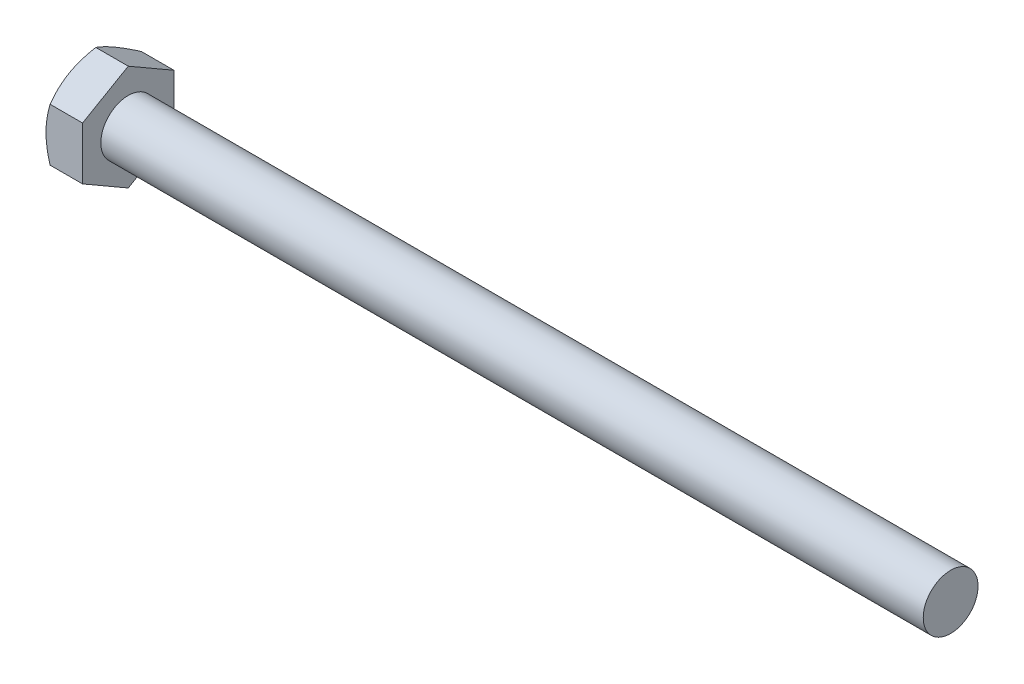
ISO-10303-21;
HEADER;
FILE_DESCRIPTION(('STEP AP214'),'2;1');
FILE_NAME('part.step','',(''),(''),'','','');
FILE_SCHEMA(('AUTOMOTIVE_DESIGN { 1 0 10303 214 1 1 1 1 }'));
ENDSEC;
DATA;
#1=APPLICATION_CONTEXT('core data for automotive mechanical design processes');
#2=APPLICATION_PROTOCOL_DEFINITION('international standard','automotive_design',2000,#1);
#3=PRODUCT_CONTEXT('',#1,'mechanical');
#4=PRODUCT('Part','Part','',(#3));
#5=PRODUCT_RELATED_PRODUCT_CATEGORY('part','',(#4));
#6=PRODUCT_DEFINITION_FORMATION('','',#4);
#7=PRODUCT_DEFINITION_CONTEXT('part definition',#1,'design');
#8=PRODUCT_DEFINITION('design','',#6,#7);
#9=PRODUCT_DEFINITION_SHAPE('','',#8);
#10=(LENGTH_UNIT() NAMED_UNIT(*) SI_UNIT(.MILLI.,.METRE.));
#11=(NAMED_UNIT(*) PLANE_ANGLE_UNIT() SI_UNIT($,.RADIAN.));
#12=(NAMED_UNIT(*) SI_UNIT($,.STERADIAN.) SOLID_ANGLE_UNIT());
#13=UNCERTAINTY_MEASURE_WITH_UNIT(LENGTH_MEASURE(1.E-05),#10,'distance_accuracy_value','');
#14=(GEOMETRIC_REPRESENTATION_CONTEXT(3) GLOBAL_UNCERTAINTY_ASSIGNED_CONTEXT((#13)) GLOBAL_UNIT_ASSIGNED_CONTEXT((#10,
#11,#12)) REPRESENTATION_CONTEXT('',''));
#15=CARTESIAN_POINT('',(0.,0.,0.));
#16=DIRECTION('',(0.,0.,1.));
#17=DIRECTION('',(1.,0.,0.));
#18=AXIS2_PLACEMENT_3D('',#15,#16,#17);
#19=CARTESIAN_POINT('',(4.,2.88675134594813,-5.));
#20=DIRECTION('',(0.,-0.866025403784438,0.500000000000001));
#21=DIRECTION('',(0.,-0.500000000000001,-0.866025403784438));
#22=AXIS2_PLACEMENT_3D('',#19,#20,#21);
#23=PLANE('',#22);
#24=CARTESIAN_POINT('',(0.44664865605183,5.7736181619501,0.0002));
#25=CARTESIAN_POINT('',(0.373386567637636,5.64675433465071,-0.219534594525185));
#26=CARTESIAN_POINT('',(0.306751321918093,5.5188054379059,-0.441148584459581));
#27=CARTESIAN_POINT('',(0.190438991010811,5.26069210252318,-0.888213995453513));
#28=CARTESIAN_POINT('',(0.14080304991579,5.13052307794721,-1.11367335959077));
#29=CARTESIAN_POINT('',(0.0635510254186983,4.87177839004641,-1.56183230522351));
#30=CARTESIAN_POINT('',(0.0354203782834896,4.74324302208387,-1.78446209310419));
#31=CARTESIAN_POINT('',(0.0101949219536843,4.54998783160116,-2.11918990184664));
#32=CARTESIAN_POINT('',(0.00461345976948367,4.48552534905128,-2.23084219680506));
#33=CARTESIAN_POINT('',(-0.000797783248530082,4.35654081066911,-2.4542499706738));
#34=CARTESIAN_POINT('',(-0.000627741741796804,4.2920187567385,-2.56600544629031));
#35=CARTESIAN_POINT('',(0.00775363179203646,4.11524635305244,-2.87218423085064));
#36=CARTESIAN_POINT('',(0.0218297718972514,4.00305457769146,-3.06650608596721));
#37=CARTESIAN_POINT('',(0.0664652571094306,3.77941563226457,-3.45386010199771));
#38=CARTESIAN_POINT('',(0.0970398601475079,3.66796924828418,-3.64689090137157));
#39=CARTESIAN_POINT('',(0.173468493621163,3.44387972423144,-4.03502534247485));
#40=CARTESIAN_POINT('',(0.219646378878679,3.3312648659868,-4.23007999864174));
#41=CARTESIAN_POINT('',(0.324451794491933,3.1077146415794,-4.61728034535877));
#42=CARTESIAN_POINT('',(0.383054703437373,2.99677641204847,-4.80943099540809));
#43=CARTESIAN_POINT('',(0.446648656051827,2.88663587589429,-5.0002));
#44=B_SPLINE_CURVE_WITH_KNOTS('',3,(#24,#25,#26,#27,#28,#29,#30,#31,#32,#33,#34,#35,#36,#37,#38,
#39,#40,#41,#42,#43),.UNSPECIFIED.,.F.,.F.,(4,2,2,2,2,2,2,2,2,4),(0.,0.792555841363091,
1.58701660053333,2.36181537487281,2.74884076077325,3.13585419177295,3.80962362599679,
4.48401723901189,5.17336882348929,5.86136694793725),.UNSPECIFIED.);
#45=CARTESIAN_POINT('',(0.446581987385203,5.77350269189626,0.));
#46=VERTEX_POINT('',#45);
#47=CARTESIAN_POINT('',(0.,4.33012701892219,-2.5));
#48=VERTEX_POINT('',#47);
#49=EDGE_CURVE('E53',#46,#48,#44,.T.);
#50=ORIENTED_EDGE('',*,*,#49,.F.);
#51=DIRECTION('',(-1.,0.,0.));
#52=VECTOR('',#51,1.);
#53=CARTESIAN_POINT('',(4.,5.77350269189626,0.));
#54=LINE('',#53,#52);
#55=CARTESIAN_POINT('',(4.,5.77350269189626,0.));
#56=VERTEX_POINT('',#55);
#57=EDGE_CURVE('E149',#56,#46,#54,.T.);
#58=ORIENTED_EDGE('',*,*,#57,.F.);
#59=DIRECTION('',(0.,0.500000000000001,0.866025403784438));
#60=VECTOR('',#59,1.);
#61=CARTESIAN_POINT('',(4.,2.88675134594813,-5.));
#62=LINE('',#61,#60);
#63=CARTESIAN_POINT('',(4.,2.88675134594813,-5.));
#64=VERTEX_POINT('',#63);
#65=EDGE_CURVE('E234',#64,#56,#62,.T.);
#66=ORIENTED_EDGE('',*,*,#65,.F.);
#67=DIRECTION('',(-1.,0.,0.));
#68=VECTOR('',#67,1.);
#69=CARTESIAN_POINT('',(4.,2.88675134594813,-5.));
#70=LINE('',#69,#68);
#71=CARTESIAN_POINT('',(0.446581987385201,2.88675134594813,-5.));
#72=VERTEX_POINT('',#71);
#73=EDGE_CURVE('E137',#64,#72,#70,.T.);
#74=ORIENTED_EDGE('',*,*,#73,.T.);
#75=EDGE_CURVE('E131',#48,#72,#44,.T.);
#76=ORIENTED_EDGE('',*,*,#75,.F.);
#77=EDGE_LOOP('',(#50,#58,#66,#74,#76));
#78=FACE_BOUND('',#77,.T.);
#79=ADVANCED_FACE('F37',(#78),#23,.F.);
#80=CARTESIAN_POINT('',(4.,5.77350269189626,0.));
#81=DIRECTION('',(0.,-0.866025403784438,-0.500000000000001));
#82=DIRECTION('',(0.,0.500000000000001,-0.866025403784438));
#83=AXIS2_PLACEMENT_3D('',#80,#81,#82);
#84=PLANE('',#83);
#85=CARTESIAN_POINT('',(0.446648656051829,2.88663587589429,5.0002));
#86=CARTESIAN_POINT('',(0.373386567637635,3.01349970319368,4.78046540547482));
#87=CARTESIAN_POINT('',(0.306751321918092,3.14144859993849,4.55885141554042));
#88=CARTESIAN_POINT('',(0.190438991010811,3.39956193532121,4.11178600454649));
#89=CARTESIAN_POINT('',(0.140803049915789,3.52973095989718,3.88632664040923));
#90=CARTESIAN_POINT('',(0.0635510254186979,3.78847564779797,3.43816769477649));
#91=CARTESIAN_POINT('',(0.03542037828349,3.91701101576052,3.21553790689581));
#92=CARTESIAN_POINT('',(0.0101949219536849,4.11026620624322,2.88081009815336));
#93=CARTESIAN_POINT('',(0.00461345976948407,4.17472868879311,2.76915780319494));
#94=CARTESIAN_POINT('',(-0.00079778324852948,4.30371322717528,2.5457500293262));
#95=CARTESIAN_POINT('',(-0.00062774174179583,4.36823528110589,2.43399455370969));
#96=CARTESIAN_POINT('',(0.00775363179203787,4.54500768479194,2.12781576914936));
#97=CARTESIAN_POINT('',(0.0218297718972524,4.65719946015293,1.93349391403279));
#98=CARTESIAN_POINT('',(0.0664652571094315,4.88083840557981,1.54613989800229));
#99=CARTESIAN_POINT('',(0.0970398601475091,4.9922847895602,1.35310909862843));
#100=CARTESIAN_POINT('',(0.173468493621165,5.21637431361295,0.964974657525145));
#101=CARTESIAN_POINT('',(0.219646378878681,5.32898917185759,0.769920001358264));
#102=CARTESIAN_POINT('',(0.324451794491935,5.55253939626498,0.382719654641231));
#103=CARTESIAN_POINT('',(0.383054703437375,5.66347762579592,0.190569004591912));
#104=CARTESIAN_POINT('',(0.44664865605183,5.7736181619501,-0.000200000000000811));
#105=B_SPLINE_CURVE_WITH_KNOTS('',3,(#85,#86,#87,#88,#89,#90,#91,#92,#93,#94,#95,#96,#97,#98,
#99,#100,#101,#102,#103,#104),.UNSPECIFIED.,.F.,.F.,(4,2,2,2,2,2,2,2,2,4),(0.,0.792555841363091,
1.58701660053333,2.36181537487281,2.74884076077325,3.13585419177295,3.80962362599679,
4.4840172390119,5.17336882348929,5.86136694793726),.UNSPECIFIED.);
#106=CARTESIAN_POINT('',(0.446581987385202,2.88675134594813,5.));
#107=VERTEX_POINT('',#106);
#108=CARTESIAN_POINT('',(0.,4.33012701892219,2.5));
#109=VERTEX_POINT('',#108);
#110=EDGE_CURVE('E60',#107,#109,#105,.T.);
#111=ORIENTED_EDGE('',*,*,#110,.F.);
#112=DIRECTION('',(-1.,0.,0.));
#113=VECTOR('',#112,1.);
#114=CARTESIAN_POINT('',(4.,2.88675134594813,5.));
#115=LINE('',#114,#113);
#116=CARTESIAN_POINT('',(4.,2.88675134594813,5.));
#117=VERTEX_POINT('',#116);
#118=EDGE_CURVE('E147',#117,#107,#115,.T.);
#119=ORIENTED_EDGE('',*,*,#118,.F.);
#120=DIRECTION('',(0.,-0.500000000000001,0.866025403784438));
#121=VECTOR('',#120,1.);
#122=CARTESIAN_POINT('',(4.,5.77350269189626,0.));
#123=LINE('',#122,#121);
#124=EDGE_CURVE('E232',#56,#117,#123,.T.);
#125=ORIENTED_EDGE('',*,*,#124,.F.);
#126=ORIENTED_EDGE('',*,*,#57,.T.);
#127=EDGE_CURVE('E164',#109,#46,#105,.T.);
#128=ORIENTED_EDGE('',*,*,#127,.F.);
#129=EDGE_LOOP('',(#111,#119,#125,#126,#128));
#130=FACE_BOUND('',#129,.T.);
#131=ADVANCED_FACE('F170',(#130),#84,.F.);
#132=CARTESIAN_POINT('',(4.,2.88675134594813,5.));
#133=DIRECTION('',(0.,0.,-1.));
#134=DIRECTION('',(0.,1.,0.));
#135=AXIS2_PLACEMENT_3D('',#132,#133,#134);
#136=PLANE('',#135);
#137=CARTESIAN_POINT('',(2.47533544689296,-7.82661640313891,5.));
#138=CARTESIAN_POINT('',(2.36879683507774,-7.60758613024923,5.));
#139=CARTESIAN_POINT('',(2.26325911833057,-7.38806071364412,5.));
#140=CARTESIAN_POINT('',(2.05474707865951,-6.94775649535435,5.));
#141=CARTESIAN_POINT('',(1.95177314617003,-6.72697750897689,5.));
#142=CARTESIAN_POINT('',(1.74844778545275,-6.28280027125598,5.));
#143=CARTESIAN_POINT('',(1.64811306490869,-6.05939434592714,5.));
#144=CARTESIAN_POINT('',(1.45145486004312,-5.61083043832922,5.));
#145=CARTESIAN_POINT('',(1.35513119080618,-5.38567253739806,5.));
#146=CARTESIAN_POINT('',(1.16445037605961,-4.92576614780204,5.));
#147=CARTESIAN_POINT('',(1.07026351405996,-4.69094667859486,5.));
#148=CARTESIAN_POINT('',(0.888844387350842,-4.21858752735364,5.));
#149=CARTESIAN_POINT('',(0.801612892640664,-3.98104754746318,5.));
#150=CARTESIAN_POINT('',(0.636341071883244,-3.50329086404365,5.));
#151=CARTESIAN_POINT('',(0.558282765149714,-3.26308044250488,5.));
#152=CARTESIAN_POINT('',(0.413813856737668,-2.77921467819532,5.));
#153=CARTESIAN_POINT('',(0.347399663631978,-2.53556042276,5.));
#154=CARTESIAN_POINT('',(0.229707450535054,-2.04600448312504,5.));
#155=CARTESIAN_POINT('',(0.17834657344248,-1.80012308686184,5.));
#156=CARTESIAN_POINT('',(0.0936230804935168,-1.30522837494366,5.));
#157=CARTESIAN_POINT('',(0.060258578924494,-1.05621539022478,5.));
#158=CARTESIAN_POINT('',(0.0146229933804858,-0.559584253783073,5.));
#159=CARTESIAN_POINT('',(0.00207498506584217,-0.311992192967681,5.));
#160=CARTESIAN_POINT('',(-0.00159747165030431,0.183375584056732,5.));
#161=CARTESIAN_POINT('',(0.00727849448086331,0.431151303726635,5.));
#162=CARTESIAN_POINT('',(0.0397265053205847,0.849622860758222,5.));
#163=CARTESIAN_POINT('',(0.0579847912618797,1.02075746544156,5.));
#164=CARTESIAN_POINT('',(0.103624049996722,1.36181398757519,5.));
#165=CARTESIAN_POINT('',(0.131006199082924,1.5317357457727,5.));
#166=CARTESIAN_POINT('',(0.225403333816322,2.03942834541586,5.));
#167=CARTESIAN_POINT('',(0.304653621104036,2.37495177168562,5.));
#168=CARTESIAN_POINT('',(0.442611792168639,2.87686006020151,5.));
#169=CARTESIAN_POINT('',(0.492453035928115,3.04583048582564,5.));
#170=CARTESIAN_POINT('',(0.597441969480139,3.38213061038658,5.));
#171=CARTESIAN_POINT('',(0.652589698776804,3.54946029709869,5.));
#172=CARTESIAN_POINT('',(0.767295730006395,3.88253122341816,5.));
#173=CARTESIAN_POINT('',(0.826852713137813,4.04827292137364,5.));
#174=CARTESIAN_POINT('',(0.94966349911005,4.37837269604183,5.));
#175=CARTESIAN_POINT('',(1.01291722636637,4.54273080096525,5.));
#176=CARTESIAN_POINT('',(1.18384085306905,4.97467594039769,5.));
#177=CARTESIAN_POINT('',(1.29410564783453,5.24123504256647,5.));
#178=CARTESIAN_POINT('',(1.52085041203992,5.77170603526333,5.));
#179=CARTESIAN_POINT('',(1.63733099805396,6.03561766007928,5.));
#180=CARTESIAN_POINT('',(1.87507624393348,6.56138078778337,5.));
#181=CARTESIAN_POINT('',(1.99634255328238,6.82323154239328,5.));
#182=CARTESIAN_POINT('',(2.24254703861692,7.34518395602015,5.));
#183=CARTESIAN_POINT('',(2.36748508200602,7.60528567778374,5.));
#184=CARTESIAN_POINT('',(2.62044102887898,8.12446478659922,5.));
#185=CARTESIAN_POINT('',(2.74846325062126,8.38354006552432,5.));
#186=CARTESIAN_POINT('',(3.00682668967549,8.9005329112754,5.));
#187=CARTESIAN_POINT('',(3.13716793074432,9.15845046620729,5.));
#188=CARTESIAN_POINT('',(3.53092424591317,9.93067662274979,5.));
#189=CARTESIAN_POINT('',(3.79712405172275,10.4435647238032,5.));
#190=CARTESIAN_POINT('',(4.30724046881171,11.4147548711532,5.));
#191=CARTESIAN_POINT('',(4.55067498762245,11.873311348306,5.));
#192=CARTESIAN_POINT('',(5.04052915785298,12.7888590468283,5.));
#193=CARTESIAN_POINT('',(5.28694897482744,13.2458501795696,5.));
#194=CARTESIAN_POINT('',(5.7812250534644,14.1571829390174,5.));
#195=CARTESIAN_POINT('',(6.02907430461245,14.6115283739736,5.));
#196=CARTESIAN_POINT('',(6.52648185519851,15.5192398746589,5.));
#197=CARTESIAN_POINT('',(6.77604002809907,15.9726060096992,5.));
#198=CARTESIAN_POINT('',(7.02622264559119,16.4256251044156,5.));
#199=B_SPLINE_CURVE_WITH_KNOTS('',3,(#137,#138,#139,#140,#141,#142,#143,#144,#145,#146,#147,
#148,#149,#150,#151,#152,#153,#154,#155,#156,#157,#158,#159,#160,#161,#162,#163,#164,#165,#166,
#167,#168,#169,#170,#171,#172,#173,#174,#175,#176,#177,#178,#179,#180,#181,#182,#183,#184,#185,
#186,#187,#188,#189,#190,#191,#192,#193,#194,#195,#196,#197,#198),.UNSPECIFIED.,.F.,.F.,(4,2,2,
2,2,2,2,2,2,2,2,2,2,2,2,2,2,2,2,2,2,2,2,2,2,2,2,2,2,2,4),(0.,0.730708682143099,1.46152797033751,
2.19620403652929,2.930846195478,3.68977491658213,4.44878753915767,5.20628666210828,
5.9635517348485,6.71656679485873,7.46950293642268,8.21233991237301,8.95519126159775,
9.4712599123247,9.98739512288343,11.0201893937443,11.5486465414698,12.0771076235976,
12.6054112774226,13.1337041332035,13.9989833719716,14.8643486020619,15.7300147459346,
16.5956496665091,17.4625765068272,18.3295122333794,20.0630293163822,21.6205191219182,
23.1780956996636,24.7307447704824,26.2832800921359),.UNSPECIFIED.);
#200=CARTESIAN_POINT('',(0.446581987385204,-2.88675134594813,5.));
#201=VERTEX_POINT('',#200);
#202=CARTESIAN_POINT('',(0.,0.,5.));
#203=VERTEX_POINT('',#202);
#204=EDGE_CURVE('E241',#201,#203,#199,.T.);
#205=ORIENTED_EDGE('',*,*,#204,.F.);
#206=DIRECTION('',(-1.,0.,0.));
#207=VECTOR('',#206,1.);
#208=CARTESIAN_POINT('',(4.,-2.88675134594813,5.));
#209=LINE('',#208,#207);
#210=CARTESIAN_POINT('',(4.,-2.88675134594813,5.));
#211=VERTEX_POINT('',#210);
#212=EDGE_CURVE('E139',#211,#201,#209,.T.);
#213=ORIENTED_EDGE('',*,*,#212,.F.);
#214=DIRECTION('',(0.,-1.,0.));
#215=VECTOR('',#214,1.);
#216=CARTESIAN_POINT('',(4.,2.88675134594813,5.));
#217=LINE('',#216,#215);
#218=EDGE_CURVE('E228',#117,#211,#217,.T.);
#219=ORIENTED_EDGE('',*,*,#218,.F.);
#220=ORIENTED_EDGE('',*,*,#118,.T.);
#221=EDGE_CURVE('E186',#203,#107,#199,.T.);
#222=ORIENTED_EDGE('',*,*,#221,.F.);
#223=EDGE_LOOP('',(#205,#213,#219,#220,#222));
#224=FACE_BOUND('',#223,.T.);
#225=ADVANCED_FACE('F247',(#224),#136,.F.);
#226=CARTESIAN_POINT('',(4.,-5.77350269189627,0.));
#227=DIRECTION('',(0.,0.866025403784438,-0.500000000000001));
#228=DIRECTION('',(0.,0.500000000000001,0.866025403784438));
#229=AXIS2_PLACEMENT_3D('',#226,#227,#228);
#230=PLANE('',#229);
#231=CARTESIAN_POINT('',(0.446648656051836,-5.77361816195011,-0.0002));
#232=CARTESIAN_POINT('',(0.373386567637641,-5.64675433465072,0.219534594525185));
#233=CARTESIAN_POINT('',(0.306751321918098,-5.51880543790591,0.441148584459581));
#234=CARTESIAN_POINT('',(0.190438991010817,-5.26069210252319,0.888213995453515));
#235=CARTESIAN_POINT('',(0.140803049915795,-5.13052307794722,1.11367335959078));
#236=CARTESIAN_POINT('',(0.0635510254187039,-4.87177839004642,1.56183230522351));
#237=CARTESIAN_POINT('',(0.0354203782834947,-4.74324302208388,1.7844620931042));
#238=CARTESIAN_POINT('',(0.0101949219536895,-4.54998783160117,2.11918990184665));
#239=CARTESIAN_POINT('',(0.00461345976948892,-4.48552534905129,2.23084219680506));
#240=CARTESIAN_POINT('',(-0.000797783248524821,-4.35654081066912,2.4542499706738));
#241=CARTESIAN_POINT('',(-0.000627741741791637,-4.29201875673851,2.56600544629032));
#242=CARTESIAN_POINT('',(0.00775363179204151,-4.11524635305245,2.87218423085064));
#243=CARTESIAN_POINT('',(0.0218297718972564,-4.00305457769147,3.06650608596722));
#244=CARTESIAN_POINT('',(0.0664652571094353,-3.77941563226458,3.45386010199771));
#245=CARTESIAN_POINT('',(0.0970398601475124,-3.66796924828419,3.64689090137157));
#246=CARTESIAN_POINT('',(0.173468493621168,-3.44387972423144,4.03502534247486));
#247=CARTESIAN_POINT('',(0.219646378878684,-3.33126486598681,4.23007999864174));
#248=CARTESIAN_POINT('',(0.324451794491937,-3.10771464157941,4.61728034535877));
#249=CARTESIAN_POINT('',(0.383054703437376,-2.99677641204848,4.80943099540809));
#250=CARTESIAN_POINT('',(0.44664865605183,-2.8866358758943,5.0002));
#251=B_SPLINE_CURVE_WITH_KNOTS('',3,(#231,#232,#233,#234,#235,#236,#237,#238,#239,#240,#241,
#242,#243,#244,#245,#246,#247,#248,#249,#250),.UNSPECIFIED.,.F.,.F.,(4,2,2,2,2,2,2,2,2,4),(0.,
0.792555841363093,1.58701660053334,2.36181537487281,2.74884076077326,3.13585419177296,
3.8096236259968,4.4840172390119,5.17336882348929,5.86136694793726),.UNSPECIFIED.);
#252=CARTESIAN_POINT('',(0.446581987385209,-5.77350269189627,0.));
#253=VERTEX_POINT('',#252);
#254=CARTESIAN_POINT('',(0.,-4.33012701892219,2.5));
#255=VERTEX_POINT('',#254);
#256=EDGE_CURVE('E172',#253,#255,#251,.T.);
#257=ORIENTED_EDGE('',*,*,#256,.F.);
#258=DIRECTION('',(-1.,0.,0.));
#259=VECTOR('',#258,1.);
#260=CARTESIAN_POINT('',(4.,-5.77350269189627,0.));
#261=LINE('',#260,#259);
#262=CARTESIAN_POINT('',(4.,-5.77350269189627,0.));
#263=VERTEX_POINT('',#262);
#264=EDGE_CURVE('E136',#263,#253,#261,.T.);
#265=ORIENTED_EDGE('',*,*,#264,.F.);
#266=DIRECTION('',(0.,-0.500000000000001,-0.866025403784438));
#267=VECTOR('',#266,1.);
#268=CARTESIAN_POINT('',(4.,-5.77350269189627,0.));
#269=LINE('',#268,#267);
#270=EDGE_CURVE('E226',#211,#263,#269,.T.);
#271=ORIENTED_EDGE('',*,*,#270,.F.);
#272=ORIENTED_EDGE('',*,*,#212,.T.);
#273=EDGE_CURVE('E174',#255,#201,#251,.T.);
#274=ORIENTED_EDGE('',*,*,#273,.F.);
#275=EDGE_LOOP('',(#257,#265,#271,#272,#274));
#276=FACE_BOUND('',#275,.T.);
#277=ADVANCED_FACE('F222',(#276),#230,.F.);
#278=CARTESIAN_POINT('',(4.,-2.88675134594814,-5.));
#279=DIRECTION('',(0.,0.866025403784438,0.500000000000001));
#280=DIRECTION('',(0.,-0.500000000000001,0.866025403784438));
#281=AXIS2_PLACEMENT_3D('',#278,#279,#280);
#282=PLANE('',#281);
#283=CARTESIAN_POINT('',(0.446648656051832,-2.8866358758943,-5.0002));
#284=CARTESIAN_POINT('',(0.373386567637638,-3.01349970319369,-4.78046540547482));
#285=CARTESIAN_POINT('',(0.306751321918095,-3.1414485999385,-4.55885141554042));
#286=CARTESIAN_POINT('',(0.190438991010815,-3.39956193532122,-4.11178600454649));
#287=CARTESIAN_POINT('',(0.140803049915793,-3.52973095989719,-3.88632664040923));
#288=CARTESIAN_POINT('',(0.0635510254187024,-3.78847564779799,-3.43816769477649));
#289=CARTESIAN_POINT('',(0.035420378283494,-3.91701101576053,-3.21553790689581));
#290=CARTESIAN_POINT('',(0.0101949219536895,-4.11026620624324,-2.88081009815336));
#291=CARTESIAN_POINT('',(0.00461345976948911,-4.17472868879312,-2.76915780319494));
#292=CARTESIAN_POINT('',(-0.000797783248524277,-4.30371322717529,-2.5457500293262));
#293=CARTESIAN_POINT('',(-0.000627741741790862,-4.3682352811059,-2.43399455370969));
#294=CARTESIAN_POINT('',(0.00775363179204291,-4.54500768479196,-2.12781576914936));
#295=CARTESIAN_POINT('',(0.0218297718972582,-4.65719946015294,-1.93349391403279));
#296=CARTESIAN_POINT('',(0.0664652571094378,-4.88083840557983,-1.54613989800229));
#297=CARTESIAN_POINT('',(0.0970398601475152,-4.99228478956021,-1.35310909862843));
#298=CARTESIAN_POINT('',(0.173468493621171,-5.21637431361296,-0.964974657525146));
#299=CARTESIAN_POINT('',(0.219646378878688,-5.3289891718576,-0.769920001358265));
#300=CARTESIAN_POINT('',(0.324451794491942,-5.55253939626499,-0.382719654641233));
#301=CARTESIAN_POINT('',(0.383054703437381,-5.66347762579593,-0.190569004591915));
#302=CARTESIAN_POINT('',(0.446648656051836,-5.77361816195011,0.00019999999999963));
#303=B_SPLINE_CURVE_WITH_KNOTS('',3,(#283,#284,#285,#286,#287,#288,#289,#290,#291,#292,#293,
#294,#295,#296,#297,#298,#299,#300,#301,#302),.UNSPECIFIED.,.F.,.F.,(4,2,2,2,2,2,2,2,2,4),(0.,
0.792555841363092,1.58701660053334,2.36181537487281,2.74884076077326,3.13585419177295,
3.8096236259968,4.48401723901189,5.17336882348929,5.86136694793725),.UNSPECIFIED.);
#304=CARTESIAN_POINT('',(0.44658198738495,-2.88675134594852,-5.));
#305=VERTEX_POINT('',#304);
#306=CARTESIAN_POINT('',(0.,-4.33012701892219,-2.5));
#307=VERTEX_POINT('',#306);
#308=EDGE_CURVE('E113',#305,#307,#303,.T.);
#309=ORIENTED_EDGE('',*,*,#308,.F.);
#310=DIRECTION('',(-1.,0.,0.));
#311=VECTOR('',#310,1.);
#312=CARTESIAN_POINT('',(4.,-2.88675134594814,-5.));
#313=LINE('',#312,#311);
#314=CARTESIAN_POINT('',(4.,-2.88675134594814,-5.));
#315=VERTEX_POINT('',#314);
#316=EDGE_CURVE('E127',#315,#305,#313,.T.);
#317=ORIENTED_EDGE('',*,*,#316,.F.);
#318=DIRECTION('',(0.,0.5,-0.866025403784438));
#319=VECTOR('',#318,1.);
#320=CARTESIAN_POINT('',(4.,-2.88675134594814,-5.));
#321=LINE('',#320,#319);
#322=EDGE_CURVE('E224',#263,#315,#321,.T.);
#323=ORIENTED_EDGE('',*,*,#322,.F.);
#324=ORIENTED_EDGE('',*,*,#264,.T.);
#325=EDGE_CURVE('E130',#307,#253,#303,.T.);
#326=ORIENTED_EDGE('',*,*,#325,.F.);
#327=EDGE_LOOP('',(#309,#317,#323,#324,#326));
#328=FACE_BOUND('',#327,.T.);
#329=ADVANCED_FACE('F125',(#328),#282,.F.);
#330=CARTESIAN_POINT('',(4.,2.88675134594813,-5.));
#331=DIRECTION('',(0.,0.,1.));
#332=DIRECTION('',(0.,-1.,0.));
#333=AXIS2_PLACEMENT_3D('',#330,#331,#332);
#334=PLANE('',#333);
#335=CARTESIAN_POINT('',(2.47533544773019,-7.82661640485968,-5.));
#336=CARTESIAN_POINT('',(2.36879683588001,-7.60758613191209,-5.));
#337=CARTESIAN_POINT('',(2.26325911909791,-7.38806071524904,-5.));
#338=CARTESIAN_POINT('',(2.05474707935716,-6.9477564968432,-5.));
#339=CARTESIAN_POINT('',(1.95177314683291,-6.72697751040763,-5.));
#340=CARTESIAN_POINT('',(1.74844778604609,-6.28280027256958,-5.));
#341=CARTESIAN_POINT('',(1.64811306546725,-6.05939434718173,-5.));
#342=CARTESIAN_POINT('',(1.4514548605327,-5.61083043946536,-5.));
#343=CARTESIAN_POINT('',(1.35513119126155,-5.38567253847479,-5.));
#344=CARTESIAN_POINT('',(1.16445037644562,-4.92576614875538,-5.));
#345=CARTESIAN_POINT('',(1.07026351441089,-4.69094667948419,-5.));
#346=CARTESIAN_POINT('',(0.888844387633476,-4.21858752811391,-5.));
#347=CARTESIAN_POINT('',(0.801612892890088,-3.98104754815841,-5.));
#348=CARTESIAN_POINT('',(0.636341072069426,-3.50329086460758,-5.));
#349=CARTESIAN_POINT('',(0.558282765305856,-3.26308044300257,-5.));
#350=CARTESIAN_POINT('',(0.413813856838631,-2.77921467855872,-5.));
#351=CARTESIAN_POINT('',(0.3473996637078,-2.53556042305535,-5.));
#352=CARTESIAN_POINT('',(0.22970745056015,-2.04600448324933,-5.));
#353=CARTESIAN_POINT('',(0.178346573443939,-1.80012308688265,-5.));
#354=CARTESIAN_POINT('',(0.0936230804633193,-1.305228374755,-5.));
#355=CARTESIAN_POINT('',(0.0602585788862665,-1.05621538993015,-5.));
#356=CARTESIAN_POINT('',(0.0146229933450857,-0.559584253278237,-5.));
#357=CARTESIAN_POINT('',(0.00207498504095154,-0.31199219235864,-5.));
#358=CARTESIAN_POINT('',(-0.00159747163599405,0.183375584872585,-5.));
#359=CARTESIAN_POINT('',(0.00727849452386985,0.431151304645095,-5.));
#360=CARTESIAN_POINT('',(0.0397265054214776,0.849622861805587,-5.));
#361=CARTESIAN_POINT('',(0.057984791385729,1.02075746651638,-5.));
#362=CARTESIAN_POINT('',(0.103624050167705,1.3618139887037,-5.));
#363=CARTESIAN_POINT('',(0.131006199278085,1.53173574692744,-5.));
#364=CARTESIAN_POINT('',(0.225403334084525,2.03942834664787,-5.));
#365=CARTESIAN_POINT('',(0.304653621421581,2.37495177296712,-5.));
#366=CARTESIAN_POINT('',(0.442611792558999,2.87686006155704,-5.));
#367=CARTESIAN_POINT('',(0.492453036342915,3.04583048720638,-5.));
#368=CARTESIAN_POINT('',(0.597441969943076,3.38213061181744,-5.));
#369=CARTESIAN_POINT('',(0.652589699263437,3.54946029855447,-5.));
#370=CARTESIAN_POINT('',(0.767295730539577,3.88253122492361,-5.));
#371=CARTESIAN_POINT('',(0.826852713693845,4.04827292290382,-5.));
#372=CARTESIAN_POINT('',(0.949663499710992,4.37837269762149,-5.));
#373=CARTESIAN_POINT('',(1.01291722698937,4.54273080256966,-5.));
#374=CARTESIAN_POINT('',(1.18384085372923,4.97467594201675,-5.));
#375=CARTESIAN_POINT('',(1.29410564850765,5.24123504417613,-5.));
#376=CARTESIAN_POINT('',(1.5208504127353,5.77170603685536,-5.));
#377=CARTESIAN_POINT('',(1.63733099875865,6.03561766166309,-5.));
#378=CARTESIAN_POINT('',(1.87507624465413,6.56138078935161,-5.));
#379=CARTESIAN_POINT('',(1.99634255400967,6.82323154395418,-5.));
#380=CARTESIAN_POINT('',(2.24254703935561,7.34518395756714,-5.));
#381=CARTESIAN_POINT('',(2.36748508274945,7.60528567932417,-5.));
#382=CARTESIAN_POINT('',(2.62044102963033,8.12446478812675,-5.));
#383=CARTESIAN_POINT('',(2.74846325137578,8.38354006704552,-5.));
#384=CARTESIAN_POINT('',(3.00682669043527,8.9005329127844,-5.));
#385=CARTESIAN_POINT('',(3.1371679315062,9.15845046771043,-5.));
#386=CARTESIAN_POINT('',(3.53092424668022,9.93067662423604,-5.));
#387=CARTESIAN_POINT('',(3.79712405249168,10.443564725279,-5.));
#388=CARTESIAN_POINT('',(4.30724046958687,11.4147548726184,-5.));
#389=CARTESIAN_POINT('',(4.55067498840223,11.8733113497711,-5.));
#390=CARTESIAN_POINT('',(5.04052915864104,12.7888590482936,-5.));
#391=CARTESIAN_POINT('',(5.28694897561916,13.2458501810351,-5.));
#392=CARTESIAN_POINT('',(5.78122505426359,14.1571829404851,-5.));
#393=CARTESIAN_POINT('',(6.02907430541544,14.6115283754434,-5.));
#394=CARTESIAN_POINT('',(6.52648185600867,15.519239876133,-5.));
#395=CARTESIAN_POINT('',(6.77604002891261,15.9726060111756,-5.));
#396=CARTESIAN_POINT('',(7.02622264640795,16.4256251058944,-5.));
#397=B_SPLINE_CURVE_WITH_KNOTS('',3,(#335,#336,#337,#338,#339,#340,#341,#342,#343,#344,#345,
#346,#347,#348,#349,#350,#351,#352,#353,#354,#355,#356,#357,#358,#359,#360,#361,#362,#363,#364,
#365,#366,#367,#368,#369,#370,#371,#372,#373,#374,#375,#376,#377,#378,#379,#380,#381,#382,#383,
#384,#385,#386,#387,#388,#389,#390,#391,#392,#393,#394,#395,#396),.UNSPECIFIED.,.F.,.F.,(4,2,2,
2,2,2,2,2,2,2,2,2,2,2,2,2,2,2,2,2,2,2,2,2,2,2,2,2,2,2,4),(0.,0.730708682345174,1.46152797074169,
2.19620403713772,2.93084619629068,3.68977491761221,4.44878754040521,5.20628666357257,
5.96355173652936,6.7165667968573,7.46950293873851,8.21233991499825,8.95519126453256,
9.47125991534871,9.98739512599665,11.0201893970363,11.5486465448551,12.0771076270762,
12.6054112809942,13.1337041368682,13.9989833756252,14.8643486057043,15.7300147495654,
16.5956496701284,17.4625765104336,18.329512236973,20.0630293199505,21.6205191254926,
23.178095703244,24.7307447740735,26.2832800957379),.UNSPECIFIED.);
#398=CARTESIAN_POINT('',(0.,0.,-5.));
#399=VERTEX_POINT('',#398);
#400=EDGE_CURVE('E119',#72,#399,#397,.F.);
#401=ORIENTED_EDGE('',*,*,#400,.F.);
#402=ORIENTED_EDGE('',*,*,#73,.F.);
#403=DIRECTION('',(0.,1.,0.));
#404=VECTOR('',#403,1.);
#405=CARTESIAN_POINT('',(4.,2.88675134594813,-5.));
#406=LINE('',#405,#404);
#407=EDGE_CURVE('E135',#315,#64,#406,.T.);
#408=ORIENTED_EDGE('',*,*,#407,.F.);
#409=ORIENTED_EDGE('',*,*,#316,.T.);
#410=EDGE_CURVE('E110',#399,#305,#397,.F.);
#411=ORIENTED_EDGE('',*,*,#410,.F.);
#412=EDGE_LOOP('',(#401,#402,#408,#409,#411));
#413=FACE_BOUND('',#412,.T.);
#414=ADVANCED_FACE('F133',(#413),#334,.F.);
#415=CARTESIAN_POINT('',(4.,5.77350269189626,0.));
#416=DIRECTION('',(1.,0.,0.));
#417=DIRECTION('',(0.,0.,-1.));
#418=AXIS2_PLACEMENT_3D('',#415,#416,#417);
#419=PLANE('',#418);
#420=CARTESIAN_POINT('',(4.,0.,0.));
#421=DIRECTION('',(1.,0.,0.));
#422=DIRECTION('',(0.,0.,-1.));
#423=AXIS2_PLACEMENT_3D('',#420,#421,#422);
#424=CIRCLE('',#423,3.);
#425=CARTESIAN_POINT('',(4.,0.,-3.));
#426=VERTEX_POINT('',#425);
#427=EDGE_CURVE('E237',#426,#426,#424,.F.);
#428=ORIENTED_EDGE('',*,*,#427,.T.);
#429=EDGE_LOOP('',(#428));
#430=FACE_BOUND('',#429,.T.);
#431=ORIENTED_EDGE('',*,*,#65,.T.);
#432=ORIENTED_EDGE('',*,*,#124,.T.);
#433=ORIENTED_EDGE('',*,*,#218,.T.);
#434=ORIENTED_EDGE('',*,*,#270,.T.);
#435=ORIENTED_EDGE('',*,*,#322,.T.);
#436=ORIENTED_EDGE('',*,*,#407,.T.);
#437=EDGE_LOOP('',(#431,#432,#433,#434,#435,#436));
#438=FACE_BOUND('',#437,.T.);
#439=ADVANCED_FACE('F249',(#430,#438),#419,.T.);
#440=CARTESIAN_POINT('',(0.,0.,0.));
#441=DIRECTION('',(-1.,0.,0.));
#442=DIRECTION('',(0.,0.,1.));
#443=AXIS2_PLACEMENT_3D('',#440,#441,#442);
#444=CYLINDRICAL_SURFACE('',#443,3.);
#445=ORIENTED_EDGE('',*,*,#427,.F.);
#446=EDGE_LOOP('',(#445));
#447=FACE_BOUND('',#446,.T.);
#448=CARTESIAN_POINT('',(94.,0.,0.));
#449=DIRECTION('',(-1.,0.,0.));
#450=DIRECTION('',(0.,0.,1.));
#451=AXIS2_PLACEMENT_3D('',#448,#449,#450);
#452=CIRCLE('',#451,3.);
#453=CARTESIAN_POINT('',(94.,0.,3.));
#454=VERTEX_POINT('',#453);
#455=EDGE_CURVE('E239',#454,#454,#452,.T.);
#456=ORIENTED_EDGE('',*,*,#455,.T.);
#457=EDGE_LOOP('',(#456));
#458=FACE_BOUND('',#457,.T.);
#459=ADVANCED_FACE('F279',(#447,#458),#444,.T.);
#460=CARTESIAN_POINT('',(94.,0.,0.));
#461=DIRECTION('',(-1.,0.,0.));
#462=DIRECTION('',(0.,0.,1.));
#463=AXIS2_PLACEMENT_3D('',#460,#461,#462);
#464=PLANE('',#463);
#465=ORIENTED_EDGE('',*,*,#455,.F.);
#466=EDGE_LOOP('',(#465));
#467=FACE_BOUND('',#466,.T.);
#468=ADVANCED_FACE('F199',(#467),#464,.F.);
#469=CARTESIAN_POINT('',(0.,0.,0.));
#470=DIRECTION('',(1.,0.,0.));
#471=DIRECTION('',(0.,0.,-1.));
#472=AXIS2_PLACEMENT_3D('',#469,#470,#471);
#473=CONICAL_SURFACE('',#472,5.,1.0471975511966);
#474=ORIENTED_EDGE('',*,*,#308,.T.);
#475=CARTESIAN_POINT('',(0.,0.,0.));
#476=DIRECTION('',(1.,0.,0.));
#477=DIRECTION('',(0.,0.,-1.));
#478=AXIS2_PLACEMENT_3D('',#475,#476,#477);
#479=CIRCLE('',#478,5.);
#480=EDGE_CURVE('E41',#307,#399,#479,.T.);
#481=ORIENTED_EDGE('',*,*,#480,.T.);
#482=ORIENTED_EDGE('',*,*,#410,.T.);
#483=EDGE_LOOP('',(#474,#481,#482));
#484=FACE_BOUND('',#483,.T.);
#485=ADVANCED_FACE('F112',(#484),#473,.T.);
#486=ORIENTED_EDGE('',*,*,#256,.T.);
#487=EDGE_CURVE('E154',#255,#307,#479,.T.);
#488=ORIENTED_EDGE('',*,*,#487,.T.);
#489=ORIENTED_EDGE('',*,*,#325,.T.);
#490=EDGE_LOOP('',(#486,#488,#489));
#491=FACE_BOUND('',#490,.T.);
#492=ADVANCED_FACE('F198',(#491),#473,.T.);
#493=ORIENTED_EDGE('',*,*,#204,.T.);
#494=EDGE_CURVE('E155',#203,#255,#479,.T.);
#495=ORIENTED_EDGE('',*,*,#494,.T.);
#496=ORIENTED_EDGE('',*,*,#273,.T.);
#497=EDGE_LOOP('',(#493,#495,#496));
#498=FACE_BOUND('',#497,.T.);
#499=ADVANCED_FACE('F193',(#498),#473,.T.);
#500=ORIENTED_EDGE('',*,*,#221,.T.);
#501=ORIENTED_EDGE('',*,*,#110,.T.);
#502=CARTESIAN_POINT('',(0.,0.,0.));
#503=DIRECTION('',(-1.,0.,0.));
#504=DIRECTION('',(0.,0.,1.));
#505=AXIS2_PLACEMENT_3D('',#502,#503,#504);
#506=CIRCLE('',#505,5.);
#507=EDGE_CURVE('E120',#203,#109,#506,.T.);
#508=ORIENTED_EDGE('',*,*,#507,.F.);
#509=EDGE_LOOP('',(#500,#501,#508));
#510=FACE_BOUND('',#509,.T.);
#511=ADVANCED_FACE('F197',(#510),#473,.T.);
#512=ORIENTED_EDGE('',*,*,#127,.T.);
#513=ORIENTED_EDGE('',*,*,#49,.T.);
#514=EDGE_CURVE('E46',#48,#109,#479,.T.);
#515=ORIENTED_EDGE('',*,*,#514,.T.);
#516=EDGE_LOOP('',(#512,#513,#515));
#517=FACE_BOUND('',#516,.T.);
#518=ADVANCED_FACE('F163',(#517),#473,.T.);
#519=ORIENTED_EDGE('',*,*,#75,.T.);
#520=ORIENTED_EDGE('',*,*,#400,.T.);
#521=EDGE_CURVE('E11',#399,#48,#479,.T.);
#522=ORIENTED_EDGE('',*,*,#521,.T.);
#523=EDGE_LOOP('',(#519,#520,#522));
#524=FACE_BOUND('',#523,.T.);
#525=ADVANCED_FACE('F252',(#524),#473,.T.);
#526=CARTESIAN_POINT('',(0.,5.77350269189626,0.));
#527=DIRECTION('',(1.,0.,0.));
#528=DIRECTION('',(0.,0.,-1.));
#529=AXIS2_PLACEMENT_3D('',#526,#527,#528);
#530=PLANE('',#529);
#531=ORIENTED_EDGE('',*,*,#521,.F.);
#532=ORIENTED_EDGE('',*,*,#480,.F.);
#533=ORIENTED_EDGE('',*,*,#487,.F.);
#534=ORIENTED_EDGE('',*,*,#494,.F.);
#535=ORIENTED_EDGE('',*,*,#507,.T.);
#536=ORIENTED_EDGE('',*,*,#514,.F.);
#537=EDGE_LOOP('',(#531,#532,#533,#534,#535,#536));
#538=FACE_BOUND('',#537,.T.);
#539=ADVANCED_FACE('F167',(#538),#530,.F.);
#540=CLOSED_SHELL('',(#79,#131,#225,#277,#329,#414,#439,#459,#468,#485,#492,#499,#511,#518,#525,#539));
#541=MANIFOLD_SOLID_BREP('B2',#540);
#542=ADVANCED_BREP_SHAPE_REPRESENTATION('',(#18,#541),#14);
#543=SHAPE_DEFINITION_REPRESENTATION(#9,#542);
ENDSEC;
END-ISO-10303-21;
